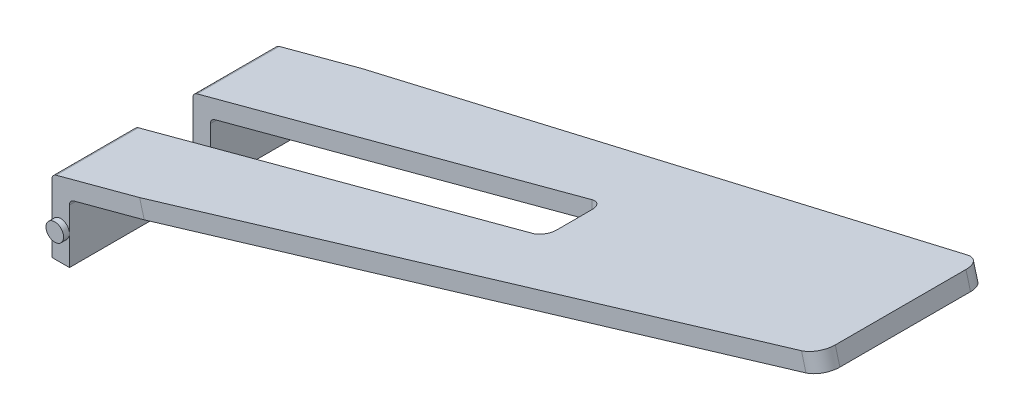
ISO-10303-21;
HEADER;
FILE_DESCRIPTION(('STEP AP214'),'2;1');
FILE_NAME('part.step','',(''),(''),'','','');
FILE_SCHEMA(('AUTOMOTIVE_DESIGN { 1 0 10303 214 1 1 1 1 }'));
ENDSEC;
DATA;
#1=APPLICATION_CONTEXT('core data for automotive mechanical design processes');
#2=APPLICATION_PROTOCOL_DEFINITION('international standard','automotive_design',2000,#1);
#3=PRODUCT_CONTEXT('',#1,'mechanical');
#4=PRODUCT('Part','Part','',(#3));
#5=PRODUCT_RELATED_PRODUCT_CATEGORY('part','',(#4));
#6=PRODUCT_DEFINITION_FORMATION('','',#4);
#7=PRODUCT_DEFINITION_CONTEXT('part definition',#1,'design');
#8=PRODUCT_DEFINITION('design','',#6,#7);
#9=PRODUCT_DEFINITION_SHAPE('','',#8);
#10=(LENGTH_UNIT() NAMED_UNIT(*) SI_UNIT(.MILLI.,.METRE.));
#11=(NAMED_UNIT(*) PLANE_ANGLE_UNIT() SI_UNIT($,.RADIAN.));
#12=(NAMED_UNIT(*) SI_UNIT($,.STERADIAN.) SOLID_ANGLE_UNIT());
#13=UNCERTAINTY_MEASURE_WITH_UNIT(LENGTH_MEASURE(1.E-05),#10,'distance_accuracy_value','');
#14=(GEOMETRIC_REPRESENTATION_CONTEXT(3) GLOBAL_UNCERTAINTY_ASSIGNED_CONTEXT((#13)) GLOBAL_UNIT_ASSIGNED_CONTEXT((#10,
#11,#12)) REPRESENTATION_CONTEXT('',''));
#15=CARTESIAN_POINT('',(0.,0.,0.));
#16=DIRECTION('',(0.,0.,1.));
#17=DIRECTION('',(1.,0.,0.));
#18=AXIS2_PLACEMENT_3D('',#15,#16,#17);
#19=CARTESIAN_POINT('',(0.3,0.,3.8));
#20=DIRECTION('',(0.,1.,0.));
#21=DIRECTION('',(0.,0.,1.));
#22=AXIS2_PLACEMENT_3D('',#19,#20,#21);
#23=PLANE('',#22);
#24=DIRECTION('',(0.,0.,-1.));
#25=VECTOR('',#24,1.);
#26=CARTESIAN_POINT('',(0.,0.,3.8));
#27=LINE('',#26,#25);
#28=CARTESIAN_POINT('',(0.,0.,3.8));
#29=VERTEX_POINT('',#28);
#30=CARTESIAN_POINT('',(0.,0.,2.40000000000001));
#31=VERTEX_POINT('',#30);
#32=EDGE_CURVE('E224',#29,#31,#27,.T.);
#33=ORIENTED_EDGE('',*,*,#32,.T.);
#34=DIRECTION('',(-1.,0.,0.));
#35=VECTOR('',#34,1.);
#36=CARTESIAN_POINT('',(0.,0.,2.40000000000001));
#37=LINE('',#36,#35);
#38=CARTESIAN_POINT('',(0.3,0.,2.40000000000001));
#39=VERTEX_POINT('',#38);
#40=EDGE_CURVE('E218',#39,#31,#37,.T.);
#41=ORIENTED_EDGE('',*,*,#40,.F.);
#42=DIRECTION('',(0.,0.,-1.));
#43=VECTOR('',#42,1.);
#44=CARTESIAN_POINT('',(0.3,0.,3.8));
#45=LINE('',#44,#43);
#46=CARTESIAN_POINT('',(0.3,0.,3.8));
#47=VERTEX_POINT('',#46);
#48=EDGE_CURVE('E240',#47,#39,#45,.T.);
#49=ORIENTED_EDGE('',*,*,#48,.F.);
#50=DIRECTION('',(1.,0.,0.));
#51=VECTOR('',#50,1.);
#52=CARTESIAN_POINT('',(0.3,0.,3.8));
#53=LINE('',#52,#51);
#54=EDGE_CURVE('E373',#29,#47,#53,.T.);
#55=ORIENTED_EDGE('',*,*,#54,.F.);
#56=EDGE_LOOP('',(#33,#41,#49,#55));
#57=FACE_BOUND('',#56,.T.);
#58=ADVANCED_FACE('F38',(#57),#23,.F.);
#59=CARTESIAN_POINT('',(0.3,1.,3.8));
#60=DIRECTION('',(-1.,0.,0.));
#61=DIRECTION('',(0.,-1.,0.));
#62=AXIS2_PLACEMENT_3D('',#59,#60,#61);
#63=PLANE('',#62);
#64=DIRECTION('',(0.,1.,0.));
#65=VECTOR('',#64,1.);
#66=CARTESIAN_POINT('',(0.3,1.,2.40000000000001));
#67=LINE('',#66,#65);
#68=CARTESIAN_POINT('',(0.3,0.923267301202103,2.40000000000001));
#69=VERTEX_POINT('',#68);
#70=EDGE_CURVE('E358',#39,#69,#67,.T.);
#71=ORIENTED_EDGE('',*,*,#70,.T.);
#72=DIRECTION('',(0.,0.,-1.));
#73=VECTOR('',#72,1.);
#74=CARTESIAN_POINT('',(0.3,0.923267301202103,3.8));
#75=LINE('',#74,#73);
#76=CARTESIAN_POINT('',(0.3,0.923267301202103,3.8));
#77=VERTEX_POINT('',#76);
#78=EDGE_CURVE('E291',#69,#77,#75,.F.);
#79=ORIENTED_EDGE('',*,*,#78,.T.);
#80=DIRECTION('',(0.,1.,0.));
#81=VECTOR('',#80,1.);
#82=CARTESIAN_POINT('',(0.3,1.,3.8));
#83=LINE('',#82,#81);
#84=CARTESIAN_POINT('',(0.3,0.5,3.8));
#85=VERTEX_POINT('',#84);
#86=EDGE_CURVE('E376',#85,#77,#83,.T.);
#87=ORIENTED_EDGE('',*,*,#86,.F.);
#88=EDGE_CURVE('E377',#47,#85,#83,.T.);
#89=ORIENTED_EDGE('',*,*,#88,.F.);
#90=ORIENTED_EDGE('',*,*,#48,.T.);
#91=EDGE_LOOP('',(#71,#79,#87,#89,#90));
#92=FACE_BOUND('',#91,.T.);
#93=ADVANCED_FACE('F427',(#92),#63,.F.);
#94=CARTESIAN_POINT('',(0.,0.,3.8));
#95=DIRECTION('',(1.,0.,0.));
#96=DIRECTION('',(0.,0.,-1.));
#97=AXIS2_PLACEMENT_3D('',#94,#95,#96);
#98=PLANE('',#97);
#99=DIRECTION('',(0.,-1.,0.));
#100=VECTOR('',#99,1.);
#101=CARTESIAN_POINT('',(0.,0.,3.8));
#102=LINE('',#101,#100);
#103=CARTESIAN_POINT('',(0.,1.15346539759579,3.8));
#104=VERTEX_POINT('',#103);
#105=CARTESIAN_POINT('',(0.,0.5,3.8));
#106=VERTEX_POINT('',#105);
#107=EDGE_CURVE('E225',#104,#106,#102,.T.);
#108=ORIENTED_EDGE('',*,*,#107,.F.);
#109=DIRECTION('',(0.,0.,-1.));
#110=VECTOR('',#109,1.);
#111=CARTESIAN_POINT('',(0.,1.15346539759579,3.8));
#112=LINE('',#111,#110);
#113=CARTESIAN_POINT('',(0.,1.15346539759579,2.40000000000001));
#114=VERTEX_POINT('',#113);
#115=EDGE_CURVE('E275',#104,#114,#112,.T.);
#116=ORIENTED_EDGE('',*,*,#115,.T.);
#117=DIRECTION('',(0.,-1.,0.));
#118=VECTOR('',#117,1.);
#119=CARTESIAN_POINT('',(0.,0.,2.40000000000001));
#120=LINE('',#119,#118);
#121=EDGE_CURVE('E209',#114,#31,#120,.T.);
#122=ORIENTED_EDGE('',*,*,#121,.T.);
#123=ORIENTED_EDGE('',*,*,#32,.F.);
#124=EDGE_CURVE('E229',#106,#29,#102,.T.);
#125=ORIENTED_EDGE('',*,*,#124,.F.);
#126=EDGE_LOOP('',(#108,#116,#122,#123,#125));
#127=FACE_BOUND('',#126,.T.);
#128=ADVANCED_FACE('F433',(#127),#98,.F.);
#129=CARTESIAN_POINT('',(0.,0.,3.8));
#130=DIRECTION('',(0.,0.,-1.));
#131=DIRECTION('',(-1.,0.,0.));
#132=AXIS2_PLACEMENT_3D('',#129,#130,#131);
#133=PLANE('',#132);
#134=DIRECTION('',(-0.965925826289069,-0.258819045102518,0.));
#135=VECTOR('',#134,1.);
#136=CARTESIAN_POINT('',(0.,1.23019809639369,3.8));
#137=LINE('',#136,#135);
#138=CARTESIAN_POINT('',(1.49536641050825,1.630880318478,3.8));
#139=VERTEX_POINT('',#138);
#140=CARTESIAN_POINT('',(0.0741180954897482,1.2500579802247,3.8));
#141=VERTEX_POINT('',#140);
#142=EDGE_CURVE('E383',#139,#141,#137,.T.);
#143=ORIENTED_EDGE('',*,*,#142,.T.);
#144=CARTESIAN_POINT('',(0.1,1.15346539759579,3.8));
#145=DIRECTION('',(0.,0.,-1.));
#146=DIRECTION('',(-1.,0.,0.));
#147=AXIS2_PLACEMENT_3D('',#144,#145,#146);
#148=CIRCLE('',#147,0.1);
#149=EDGE_CURVE('E281',#141,#104,#148,.F.);
#150=ORIENTED_EDGE('',*,*,#149,.T.);
#151=ORIENTED_EDGE('',*,*,#107,.T.);
#152=CARTESIAN_POINT('',(0.15,0.5,3.8));
#153=DIRECTION('',(0.,0.,-1.));
#154=DIRECTION('',(-1.,0.,0.));
#155=AXIS2_PLACEMENT_3D('',#152,#153,#154);
#156=CIRCLE('',#155,0.15);
#157=EDGE_CURVE('E372',#106,#85,#156,.T.);
#158=ORIENTED_EDGE('',*,*,#157,.T.);
#159=ORIENTED_EDGE('',*,*,#86,.T.);
#160=CARTESIAN_POINT('',(0.399999999999999,0.923267301202103,3.8));
#161=DIRECTION('',(0.,0.,-1.));
#162=DIRECTION('',(-1.,0.,0.));
#163=AXIS2_PLACEMENT_3D('',#160,#161,#162);
#164=CIRCLE('',#163,0.1);
#165=CARTESIAN_POINT('',(0.374118095489749,1.01985988383101,3.8));
#166=VERTEX_POINT('',#165);
#167=EDGE_CURVE('E300',#77,#166,#164,.T.);
#168=ORIENTED_EDGE('',*,*,#167,.T.);
#169=DIRECTION('',(0.965925826289069,0.258819045102518,0.));
#170=VECTOR('',#169,1.);
#171=CARTESIAN_POINT('',(12.6346814552887,4.3050679348397,3.8));
#172=LINE('',#171,#170);
#173=CARTESIAN_POINT('',(1.57301212403901,1.34110257059128,3.8));
#174=VERTEX_POINT('',#173);
#175=EDGE_CURVE('E380',#166,#174,#172,.T.);
#176=ORIENTED_EDGE('',*,*,#175,.T.);
#177=DIRECTION('',(-0.258819045102518,0.965925826289069,0.));
#178=VECTOR('',#177,1.);
#179=CARTESIAN_POINT('',(1.80291593460667,0.483089868699056,3.8));
#180=LINE('',#179,#178);
#181=EDGE_CURVE('E243',#174,#139,#180,.T.);
#182=ORIENTED_EDGE('',*,*,#181,.T.);
#183=EDGE_LOOP('',(#143,#150,#151,#158,#159,#168,#176,#182));
#184=FACE_BOUND('',#183,.T.);
#185=ADVANCED_FACE('F444',(#184),#133,.F.);
#186=CARTESIAN_POINT('',(0.,0.,0.));
#187=DIRECTION('',(0.,0.,-1.));
#188=DIRECTION('',(-1.,0.,0.));
#189=AXIS2_PLACEMENT_3D('',#186,#187,#188);
#190=PLANE('',#189);
#191=DIRECTION('',(0.,-1.,0.));
#192=VECTOR('',#191,1.);
#193=CARTESIAN_POINT('',(0.,0.,0.));
#194=LINE('',#193,#192);
#195=CARTESIAN_POINT('',(0.,1.15346539759579,0.));
#196=VERTEX_POINT('',#195);
#197=CARTESIAN_POINT('',(0.,0.5,0.));
#198=VERTEX_POINT('',#197);
#199=EDGE_CURVE('E233',#196,#198,#194,.T.);
#200=ORIENTED_EDGE('',*,*,#199,.F.);
#201=CARTESIAN_POINT('',(0.1,1.15346539759579,0.));
#202=DIRECTION('',(0.,0.,-1.));
#203=DIRECTION('',(-1.,0.,0.));
#204=AXIS2_PLACEMENT_3D('',#201,#202,#203);
#205=CIRCLE('',#204,0.1);
#206=CARTESIAN_POINT('',(0.0741180954897482,1.2500579802247,0.));
#207=VERTEX_POINT('',#206);
#208=EDGE_CURVE('E268',#196,#207,#205,.T.);
#209=ORIENTED_EDGE('',*,*,#208,.T.);
#210=DIRECTION('',(-0.965925826289069,-0.258819045102518,0.));
#211=VECTOR('',#210,1.);
#212=CARTESIAN_POINT('',(0.,1.23019809639369,0.));
#213=LINE('',#212,#211);
#214=CARTESIAN_POINT('',(1.49536641050825,1.630880318478,0.));
#215=VERTEX_POINT('',#214);
#216=EDGE_CURVE('E393',#215,#207,#213,.T.);
#217=ORIENTED_EDGE('',*,*,#216,.F.);
#218=DIRECTION('',(0.258819045102518,-0.965925826289069,0.));
#219=VECTOR('',#218,1.);
#220=CARTESIAN_POINT('',(1.57301212403901,1.34110257059127,0.));
#221=LINE('',#220,#219);
#222=CARTESIAN_POINT('',(1.57301212403901,1.34110257059128,0.));
#223=VERTEX_POINT('',#222);
#224=EDGE_CURVE('E256',#215,#223,#221,.T.);
#225=ORIENTED_EDGE('',*,*,#224,.T.);
#226=DIRECTION('',(0.965925826289069,0.258819045102518,0.));
#227=VECTOR('',#226,1.);
#228=CARTESIAN_POINT('',(12.6346814552887,4.3050679348397,0.));
#229=LINE('',#228,#227);
#230=CARTESIAN_POINT('',(0.374118095489749,1.01985988383101,0.));
#231=VERTEX_POINT('',#230);
#232=EDGE_CURVE('E392',#231,#223,#229,.T.);
#233=ORIENTED_EDGE('',*,*,#232,.F.);
#234=CARTESIAN_POINT('',(0.399999999999999,0.923267301202103,0.));
#235=DIRECTION('',(0.,0.,-1.));
#236=DIRECTION('',(-1.,0.,0.));
#237=AXIS2_PLACEMENT_3D('',#234,#235,#236);
#238=CIRCLE('',#237,0.1);
#239=CARTESIAN_POINT('',(0.3,0.923267301202103,0.));
#240=VERTEX_POINT('',#239);
#241=EDGE_CURVE('E293',#231,#240,#238,.F.);
#242=ORIENTED_EDGE('',*,*,#241,.T.);
#243=DIRECTION('',(0.,1.,0.));
#244=VECTOR('',#243,1.);
#245=CARTESIAN_POINT('',(0.3,1.,0.));
#246=LINE('',#245,#244);
#247=CARTESIAN_POINT('',(0.3,0.5,0.));
#248=VERTEX_POINT('',#247);
#249=EDGE_CURVE('E388',#248,#240,#246,.T.);
#250=ORIENTED_EDGE('',*,*,#249,.F.);
#251=CARTESIAN_POINT('',(0.15,0.5,0.));
#252=DIRECTION('',(0.,0.,-1.));
#253=DIRECTION('',(-1.,0.,0.));
#254=AXIS2_PLACEMENT_3D('',#251,#252,#253);
#255=CIRCLE('',#254,0.15);
#256=EDGE_CURVE('E210',#198,#248,#255,.T.);
#257=ORIENTED_EDGE('',*,*,#256,.F.);
#258=EDGE_LOOP('',(#200,#209,#217,#225,#233,#242,#250,#257));
#259=FACE_BOUND('',#258,.T.);
#260=ADVANCED_FACE('F405',(#259),#190,.T.);
#261=CARTESIAN_POINT('',(0.3,0.,1.4));
#262=VERTEX_POINT('',#261);
#263=CARTESIAN_POINT('',(0.3,0.,0.));
#264=VERTEX_POINT('',#263);
#265=EDGE_CURVE('E217',#262,#264,#45,.T.);
#266=ORIENTED_EDGE('',*,*,#265,.F.);
#267=DIRECTION('',(1.,0.,0.));
#268=VECTOR('',#267,1.);
#269=CARTESIAN_POINT('',(0.,0.,1.4));
#270=LINE('',#269,#268);
#271=CARTESIAN_POINT('',(0.,0.,1.4));
#272=VERTEX_POINT('',#271);
#273=EDGE_CURVE('E201',#272,#262,#270,.T.);
#274=ORIENTED_EDGE('',*,*,#273,.F.);
#275=CARTESIAN_POINT('',(0.,0.,0.));
#276=VERTEX_POINT('',#275);
#277=EDGE_CURVE('E215',#272,#276,#27,.T.);
#278=ORIENTED_EDGE('',*,*,#277,.T.);
#279=DIRECTION('',(1.,0.,0.));
#280=VECTOR('',#279,1.);
#281=CARTESIAN_POINT('',(0.3,0.,0.));
#282=LINE('',#281,#280);
#283=EDGE_CURVE('E386',#276,#264,#282,.T.);
#284=ORIENTED_EDGE('',*,*,#283,.T.);
#285=EDGE_LOOP('',(#266,#274,#278,#284));
#286=FACE_BOUND('',#285,.T.);
#287=ADVANCED_FACE('F213',(#286),#23,.F.);
#288=ORIENTED_EDGE('',*,*,#249,.T.);
#289=DIRECTION('',(0.,0.,-1.));
#290=VECTOR('',#289,1.);
#291=CARTESIAN_POINT('',(0.3,0.923267301202103,1.4));
#292=LINE('',#291,#290);
#293=CARTESIAN_POINT('',(0.3,0.923267301202103,1.4));
#294=VERTEX_POINT('',#293);
#295=EDGE_CURVE('E289',#240,#294,#292,.F.);
#296=ORIENTED_EDGE('',*,*,#295,.T.);
#297=DIRECTION('',(0.,-1.,0.));
#298=VECTOR('',#297,1.);
#299=CARTESIAN_POINT('',(0.3,1.,1.4));
#300=LINE('',#299,#298);
#301=EDGE_CURVE('E348',#294,#262,#300,.T.);
#302=ORIENTED_EDGE('',*,*,#301,.T.);
#303=ORIENTED_EDGE('',*,*,#265,.T.);
#304=EDGE_CURVE('E389',#264,#248,#246,.T.);
#305=ORIENTED_EDGE('',*,*,#304,.T.);
#306=EDGE_LOOP('',(#288,#296,#302,#303,#305));
#307=FACE_BOUND('',#306,.T.);
#308=ADVANCED_FACE('F436',(#307),#63,.F.);
#309=CARTESIAN_POINT('',(12.6346814552887,4.3050679348397,3.8));
#310=DIRECTION('',(-0.258819045102518,0.965925826289069,0.));
#311=DIRECTION('',(-0.965925826289069,-0.258819045102518,0.));
#312=AXIS2_PLACEMENT_3D('',#309,#310,#311);
#313=PLANE('',#312);
#314=DIRECTION('',(0.965006478934081,0.258572706721185,0.0436193873653364));
#315=VECTOR('',#314,1.);
#316=CARTESIAN_POINT('',(12.6346814552887,4.3050679348397,0.5));
#317=LINE('',#316,#315);
#318=CARTESIAN_POINT('',(12.3575436352369,4.2308090797647,0.487473056201885));
#319=VERTEX_POINT('',#318);
#320=EDGE_CURVE('E251',#223,#319,#317,.T.);
#321=ORIENTED_EDGE('',*,*,#320,.T.);
#322=CARTESIAN_POINT('',(12.3449037074019,4.22742222130895,0.787187522676442));
#323=DIRECTION('',(-0.258819045102518,0.965925826289069,0.));
#324=DIRECTION('',(-0.965925826289069,-0.258819045102518,0.));
#325=AXIS2_PLACEMENT_3D('',#322,#323,#324);
#326=CIRCLE('',#325,0.3);
#327=CARTESIAN_POINT('',(12.6346814552887,4.3050679348397,0.787187522676443));
#328=VERTEX_POINT('',#327);
#329=EDGE_CURVE('E316',#319,#328,#326,.F.);
#330=ORIENTED_EDGE('',*,*,#329,.T.);
#331=DIRECTION('',(0.,0.,-1.));
#332=VECTOR('',#331,1.);
#333=CARTESIAN_POINT('',(12.6346814552887,4.3050679348397,3.8));
#334=LINE('',#333,#332);
#335=CARTESIAN_POINT('',(12.6346814552887,4.3050679348397,3.01281247732356));
#336=VERTEX_POINT('',#335);
#337=EDGE_CURVE('E237',#336,#328,#334,.T.);
#338=ORIENTED_EDGE('',*,*,#337,.F.);
#339=CARTESIAN_POINT('',(12.3449037074019,4.22742222130895,3.01281247732356));
#340=DIRECTION('',(-0.258819045102518,0.965925826289069,0.));
#341=DIRECTION('',(-0.965925826289069,-0.258819045102518,0.));
#342=AXIS2_PLACEMENT_3D('',#339,#340,#341);
#343=CIRCLE('',#342,0.3);
#344=CARTESIAN_POINT('',(12.3575436352369,4.2308090797647,3.31252694379812));
#345=VERTEX_POINT('',#344);
#346=EDGE_CURVE('E314',#336,#345,#343,.F.);
#347=ORIENTED_EDGE('',*,*,#346,.T.);
#348=DIRECTION('',(0.965006478934081,0.258572706721185,-0.0436193873653364));
#349=VECTOR('',#348,1.);
#350=CARTESIAN_POINT('',(1.57301212403901,1.34110257059128,3.8));
#351=LINE('',#350,#349);
#352=EDGE_CURVE('E254',#345,#174,#351,.F.);
#353=ORIENTED_EDGE('',*,*,#352,.T.);
#354=ORIENTED_EDGE('',*,*,#175,.F.);
#355=DIRECTION('',(0.,0.,-1.));
#356=VECTOR('',#355,1.);
#357=CARTESIAN_POINT('',(0.374118095489747,1.01985988383101,2.40000000000001));
#358=LINE('',#357,#356);
#359=CARTESIAN_POINT('',(0.374118095489746,1.01985988383101,2.40000000000001));
#360=VERTEX_POINT('',#359);
#361=EDGE_CURVE('E283',#166,#360,#358,.T.);
#362=ORIENTED_EDGE('',*,*,#361,.T.);
#363=DIRECTION('',(0.965925826289069,0.258819045102518,0.));
#364=VECTOR('',#363,1.);
#365=CARTESIAN_POINT('',(12.6346814552887,4.3050679348397,2.40000000000001));
#366=LINE('',#365,#364);
#367=CARTESIAN_POINT('',(6.8,2.74166975080228,2.40000000000001));
#368=VERTEX_POINT('',#367);
#369=EDGE_CURVE('E347',#360,#368,#366,.T.);
#370=ORIENTED_EDGE('',*,*,#369,.T.);
#371=CARTESIAN_POINT('',(6.8,2.74166975080228,2.20000000000001));
#372=DIRECTION('',(-0.258819045102518,0.965925826289069,0.));
#373=DIRECTION('',(0.965925826289069,0.258819045102518,0.));
#374=AXIS2_PLACEMENT_3D('',#371,#372,#373);
#375=ELLIPSE('',#374,0.207055236082016,0.2);
#376=CARTESIAN_POINT('',(7.,2.7952595892885,2.20000000000001));
#377=VERTEX_POINT('',#376);
#378=EDGE_CURVE('E329',#368,#377,#375,.T.);
#379=ORIENTED_EDGE('',*,*,#378,.T.);
#380=DIRECTION('',(0.,0.,-1.));
#381=VECTOR('',#380,1.);
#382=CARTESIAN_POINT('',(7.,2.7952595892885,3.79999999999999));
#383=LINE('',#382,#381);
#384=CARTESIAN_POINT('',(7.,2.7952595892885,1.60000000000001));
#385=VERTEX_POINT('',#384);
#386=EDGE_CURVE('E353',#377,#385,#383,.T.);
#387=ORIENTED_EDGE('',*,*,#386,.T.);
#388=CARTESIAN_POINT('',(6.8,2.74166975080228,1.60000000000001));
#389=DIRECTION('',(-0.258819045102518,0.965925826289069,0.));
#390=DIRECTION('',(0.965925826289069,0.258819045102518,0.));
#391=AXIS2_PLACEMENT_3D('',#388,#389,#390);
#392=ELLIPSE('',#391,0.207055236082016,0.2);
#393=CARTESIAN_POINT('',(6.8,2.74166975080228,1.40000000000001));
#394=VERTEX_POINT('',#393);
#395=EDGE_CURVE('E46',#385,#394,#392,.T.);
#396=ORIENTED_EDGE('',*,*,#395,.T.);
#397=DIRECTION('',(-0.965925826289069,-0.258819045102518,0.));
#398=VECTOR('',#397,1.);
#399=CARTESIAN_POINT('',(12.6346814552887,4.3050679348397,1.40000000000002));
#400=LINE('',#399,#398);
#401=CARTESIAN_POINT('',(0.374118095489746,1.01985988383101,1.4));
#402=VERTEX_POINT('',#401);
#403=EDGE_CURVE('E478',#394,#402,#400,.T.);
#404=ORIENTED_EDGE('',*,*,#403,.T.);
#405=DIRECTION('',(0.,0.,-1.));
#406=VECTOR('',#405,1.);
#407=CARTESIAN_POINT('',(0.374118095489747,1.01985988383101,0.));
#408=LINE('',#407,#406);
#409=EDGE_CURVE('E286',#402,#231,#408,.T.);
#410=ORIENTED_EDGE('',*,*,#409,.T.);
#411=ORIENTED_EDGE('',*,*,#232,.T.);
#412=EDGE_LOOP('',(#321,#330,#338,#347,#353,#354,#362,#370,#379,#387,#396,#404,#410,#411));
#413=FACE_BOUND('',#412,.T.);
#414=ADVANCED_FACE('F352',(#413),#313,.F.);
#415=CARTESIAN_POINT('',(12.5570357417579,4.59484568272643,3.8));
#416=DIRECTION('',(-0.965925826289069,-0.258819045102518,0.));
#417=DIRECTION('',(0.258819045102518,-0.965925826289069,0.));
#418=AXIS2_PLACEMENT_3D('',#415,#416,#417);
#419=PLANE('',#418);
#420=ORIENTED_EDGE('',*,*,#337,.T.);
#421=DIRECTION('',(-0.258819045102518,0.965925826289069,0.));
#422=VECTOR('',#421,1.);
#423=CARTESIAN_POINT('',(12.5570357417579,4.59484568272643,0.787187522676442));
#424=LINE('',#423,#422);
#425=CARTESIAN_POINT('',(12.5570357417579,4.59484568272643,0.787187522676443));
#426=VERTEX_POINT('',#425);
#427=EDGE_CURVE('E305',#328,#426,#424,.T.);
#428=ORIENTED_EDGE('',*,*,#427,.T.);
#429=DIRECTION('',(0.,0.,-1.));
#430=VECTOR('',#429,1.);
#431=CARTESIAN_POINT('',(12.5570357417579,4.59484568272643,3.8));
#432=LINE('',#431,#430);
#433=CARTESIAN_POINT('',(12.5570357417579,4.59484568272643,3.01281247732356));
#434=VERTEX_POINT('',#433);
#435=EDGE_CURVE('E228',#434,#426,#432,.T.);
#436=ORIENTED_EDGE('',*,*,#435,.F.);
#437=DIRECTION('',(-0.258819045102518,0.965925826289069,0.));
#438=VECTOR('',#437,1.);
#439=CARTESIAN_POINT('',(12.6346814552887,4.3050679348397,3.01281247732356));
#440=LINE('',#439,#438);
#441=EDGE_CURVE('E302',#434,#336,#440,.F.);
#442=ORIENTED_EDGE('',*,*,#441,.T.);
#443=EDGE_LOOP('',(#420,#428,#436,#442));
#444=FACE_BOUND('',#443,.T.);
#445=ADVANCED_FACE('F502',(#444),#419,.F.);
#446=CARTESIAN_POINT('',(0.,1.23019809639369,3.8));
#447=DIRECTION('',(0.258819045102518,-0.965925826289069,0.));
#448=DIRECTION('',(0.965925826289069,0.258819045102518,0.));
#449=AXIS2_PLACEMENT_3D('',#446,#447,#448);
#450=PLANE('',#449);
#451=ORIENTED_EDGE('',*,*,#435,.T.);
#452=CARTESIAN_POINT('',(12.2672579938712,4.51719996919567,0.787187522676442));
#453=DIRECTION('',(0.258819045102518,-0.965925826289069,0.));
#454=DIRECTION('',(0.965925826289069,0.258819045102518,0.));
#455=AXIS2_PLACEMENT_3D('',#452,#453,#454);
#456=CIRCLE('',#455,0.3);
#457=CARTESIAN_POINT('',(12.2798979217061,4.52058682765143,0.487473056201885));
#458=VERTEX_POINT('',#457);
#459=EDGE_CURVE('E310',#426,#458,#456,.F.);
#460=ORIENTED_EDGE('',*,*,#459,.T.);
#461=DIRECTION('',(-0.965006478934081,-0.258572706721186,-0.0436193873653365));
#462=VECTOR('',#461,1.);
#463=CARTESIAN_POINT('',(12.5570357417579,4.59484568272643,0.5));
#464=LINE('',#463,#462);
#465=EDGE_CURVE('E246',#458,#215,#464,.T.);
#466=ORIENTED_EDGE('',*,*,#465,.T.);
#467=ORIENTED_EDGE('',*,*,#216,.T.);
#468=DIRECTION('',(0.,0.,-1.));
#469=VECTOR('',#468,1.);
#470=CARTESIAN_POINT('',(0.0741180954897482,1.2500579802247,3.8));
#471=LINE('',#470,#469);
#472=CARTESIAN_POINT('',(0.0741180954897481,1.2500579802247,1.4));
#473=VERTEX_POINT('',#472);
#474=EDGE_CURVE('E272',#207,#473,#471,.F.);
#475=ORIENTED_EDGE('',*,*,#474,.T.);
#476=DIRECTION('',(0.965925826289069,0.258819045102518,0.));
#477=VECTOR('',#476,1.);
#478=CARTESIAN_POINT('',(0.,1.23019809639369,1.4));
#479=LINE('',#478,#477);
#480=CARTESIAN_POINT('',(6.8,3.05225260492531,1.40000000000001));
#481=VERTEX_POINT('',#480);
#482=EDGE_CURVE('E480',#473,#481,#479,.T.);
#483=ORIENTED_EDGE('',*,*,#482,.T.);
#484=CARTESIAN_POINT('',(6.8,3.0522526049253,1.60000000000001));
#485=DIRECTION('',(0.258819045102518,-0.965925826289069,0.));
#486=DIRECTION('',(0.965925826289069,0.258819045102518,0.));
#487=AXIS2_PLACEMENT_3D('',#484,#485,#486);
#488=ELLIPSE('',#487,0.207055236082016,0.2);
#489=CARTESIAN_POINT('',(7.,3.10584244341153,1.60000000000001));
#490=VERTEX_POINT('',#489);
#491=EDGE_CURVE('E11',#481,#490,#488,.T.);
#492=ORIENTED_EDGE('',*,*,#491,.T.);
#493=DIRECTION('',(0.,0.,1.));
#494=VECTOR('',#493,1.);
#495=CARTESIAN_POINT('',(7.,3.10584244341153,3.80000000000001));
#496=LINE('',#495,#494);
#497=CARTESIAN_POINT('',(7.,3.10584244341153,2.20000000000001));
#498=VERTEX_POINT('',#497);
#499=EDGE_CURVE('E263',#490,#498,#496,.T.);
#500=ORIENTED_EDGE('',*,*,#499,.T.);
#501=CARTESIAN_POINT('',(6.8,3.0522526049253,2.20000000000001));
#502=DIRECTION('',(0.258819045102518,-0.965925826289069,0.));
#503=DIRECTION('',(0.965925826289069,0.258819045102518,0.));
#504=AXIS2_PLACEMENT_3D('',#501,#502,#503);
#505=ELLIPSE('',#504,0.207055236082016,0.2);
#506=CARTESIAN_POINT('',(6.8,3.05225260492531,2.40000000000001));
#507=VERTEX_POINT('',#506);
#508=EDGE_CURVE('E331',#498,#507,#505,.T.);
#509=ORIENTED_EDGE('',*,*,#508,.T.);
#510=DIRECTION('',(-0.965925826289069,-0.258819045102518,0.));
#511=VECTOR('',#510,1.);
#512=CARTESIAN_POINT('',(0.,1.23019809639369,2.40000000000001));
#513=LINE('',#512,#511);
#514=CARTESIAN_POINT('',(0.0741180954897482,1.2500579802247,2.40000000000001));
#515=VERTEX_POINT('',#514);
#516=EDGE_CURVE('E336',#507,#515,#513,.T.);
#517=ORIENTED_EDGE('',*,*,#516,.T.);
#518=DIRECTION('',(0.,0.,-1.));
#519=VECTOR('',#518,1.);
#520=CARTESIAN_POINT('',(0.0741180954897482,1.2500579802247,3.8));
#521=LINE('',#520,#519);
#522=EDGE_CURVE('E270',#515,#141,#521,.F.);
#523=ORIENTED_EDGE('',*,*,#522,.T.);
#524=ORIENTED_EDGE('',*,*,#142,.F.);
#525=DIRECTION('',(-0.965006478934081,-0.258572706721186,0.0436193873653365));
#526=VECTOR('',#525,1.);
#527=CARTESIAN_POINT('',(1.49536641050825,1.630880318478,3.8));
#528=LINE('',#527,#526);
#529=CARTESIAN_POINT('',(12.2798979217061,4.52058682765143,3.31252694379812));
#530=VERTEX_POINT('',#529);
#531=EDGE_CURVE('E248',#139,#530,#528,.F.);
#532=ORIENTED_EDGE('',*,*,#531,.T.);
#533=CARTESIAN_POINT('',(12.2672579938712,4.51719996919567,3.01281247732356));
#534=DIRECTION('',(0.258819045102518,-0.965925826289069,0.));
#535=DIRECTION('',(0.965925826289069,0.258819045102518,0.));
#536=AXIS2_PLACEMENT_3D('',#533,#534,#535);
#537=CIRCLE('',#536,0.3);
#538=EDGE_CURVE('E308',#530,#434,#537,.F.);
#539=ORIENTED_EDGE('',*,*,#538,.T.);
#540=EDGE_LOOP('',(#451,#460,#466,#467,#475,#483,#492,#500,#509,#517,#523,#524,#532,#539));
#541=FACE_BOUND('',#540,.T.);
#542=ADVANCED_FACE('F335',(#541),#450,.F.);
#543=DIRECTION('',(0.,1.,0.));
#544=VECTOR('',#543,1.);
#545=CARTESIAN_POINT('',(0.,0.,1.4));
#546=LINE('',#545,#544);
#547=CARTESIAN_POINT('',(0.,1.15346539759579,1.4));
#548=VERTEX_POINT('',#547);
#549=EDGE_CURVE('E197',#272,#548,#546,.T.);
#550=ORIENTED_EDGE('',*,*,#549,.T.);
#551=DIRECTION('',(0.,0.,-1.));
#552=VECTOR('',#551,1.);
#553=CARTESIAN_POINT('',(0.,1.15346539759579,3.8));
#554=LINE('',#553,#552);
#555=EDGE_CURVE('E266',#548,#196,#554,.T.);
#556=ORIENTED_EDGE('',*,*,#555,.T.);
#557=ORIENTED_EDGE('',*,*,#199,.T.);
#558=EDGE_CURVE('E222',#198,#276,#194,.T.);
#559=ORIENTED_EDGE('',*,*,#558,.T.);
#560=ORIENTED_EDGE('',*,*,#277,.F.);
#561=EDGE_LOOP('',(#550,#556,#557,#559,#560));
#562=FACE_BOUND('',#561,.T.);
#563=ADVANCED_FACE('F220',(#562),#98,.F.);
#564=ORIENTED_EDGE('',*,*,#88,.T.);
#565=EDGE_CURVE('E369',#85,#106,#156,.T.);
#566=ORIENTED_EDGE('',*,*,#565,.T.);
#567=ORIENTED_EDGE('',*,*,#124,.T.);
#568=ORIENTED_EDGE('',*,*,#54,.T.);
#569=EDGE_LOOP('',(#564,#566,#567,#568));
#570=FACE_BOUND('',#569,.T.);
#571=ADVANCED_FACE('F451',(#570),#133,.F.);
#572=EDGE_CURVE('E259',#248,#198,#255,.T.);
#573=ORIENTED_EDGE('',*,*,#572,.F.);
#574=ORIENTED_EDGE('',*,*,#304,.F.);
#575=ORIENTED_EDGE('',*,*,#283,.F.);
#576=ORIENTED_EDGE('',*,*,#558,.F.);
#577=EDGE_LOOP('',(#573,#574,#575,#576));
#578=FACE_BOUND('',#577,.T.);
#579=ADVANCED_FACE('F401',(#578),#190,.T.);
#580=CARTESIAN_POINT('',(1.80291593460667,0.483089868699056,3.8));
#581=DIRECTION('',(-0.0421330927830856,-0.0112895281858532,-0.999048221581858));
#582=DIRECTION('',(-0.258819045102518,0.965925826289069,0.));
#583=AXIS2_PLACEMENT_3D('',#580,#581,#582);
#584=PLANE('',#583);
#585=ORIENTED_EDGE('',*,*,#352,.F.);
#586=DIRECTION('',(0.258819045102518,-0.965925826289069,0.));
#587=VECTOR('',#586,1.);
#588=CARTESIAN_POINT('',(12.2798979217061,4.52058682765143,3.31252694379811));
#589=LINE('',#588,#587);
#590=EDGE_CURVE('E318',#345,#530,#589,.F.);
#591=ORIENTED_EDGE('',*,*,#590,.T.);
#592=ORIENTED_EDGE('',*,*,#531,.F.);
#593=ORIENTED_EDGE('',*,*,#181,.F.);
#594=EDGE_LOOP('',(#585,#591,#592,#593));
#595=FACE_BOUND('',#594,.T.);
#596=ADVANCED_FACE('F422',(#595),#584,.F.);
#597=CARTESIAN_POINT('',(12.5570357417579,4.59484568272643,0.5));
#598=DIRECTION('',(0.0421330927830856,0.0112895281858532,-0.999048221581858));
#599=DIRECTION('',(0.258819045102518,-0.965925826289069,0.));
#600=AXIS2_PLACEMENT_3D('',#597,#598,#599);
#601=PLANE('',#600);
#602=ORIENTED_EDGE('',*,*,#465,.F.);
#603=DIRECTION('',(-0.258819045102518,0.965925826289069,0.));
#604=VECTOR('',#603,1.);
#605=CARTESIAN_POINT('',(12.3575436352369,4.2308090797647,0.487473056201885));
#606=LINE('',#605,#604);
#607=EDGE_CURVE('E312',#458,#319,#606,.F.);
#608=ORIENTED_EDGE('',*,*,#607,.T.);
#609=ORIENTED_EDGE('',*,*,#320,.F.);
#610=ORIENTED_EDGE('',*,*,#224,.F.);
#611=EDGE_LOOP('',(#602,#608,#609,#610));
#612=FACE_BOUND('',#611,.T.);
#613=ADVANCED_FACE('F417',(#612),#601,.T.);
#614=CARTESIAN_POINT('',(0.15,0.5,-0.0999999999999998));
#615=DIRECTION('',(0.,0.,1.));
#616=DIRECTION('',(1.,0.,0.));
#617=AXIS2_PLACEMENT_3D('',#614,#615,#616);
#618=PLANE('',#617);
#619=CARTESIAN_POINT('',(0.15,0.5,-0.0999999999999998));
#620=DIRECTION('',(0.,0.,1.));
#621=DIRECTION('',(1.,0.,0.));
#622=AXIS2_PLACEMENT_3D('',#619,#620,#621);
#623=CIRCLE('',#622,0.15);
#624=CARTESIAN_POINT('',(0.3,0.5,-0.0999999999999998));
#625=VERTEX_POINT('',#624);
#626=EDGE_CURVE('E361',#625,#625,#623,.T.);
#627=ORIENTED_EDGE('',*,*,#626,.F.);
#628=EDGE_LOOP('',(#627));
#629=FACE_BOUND('',#628,.T.);
#630=ADVANCED_FACE('F412',(#629),#618,.F.);
#631=CARTESIAN_POINT('',(0.15,0.5,-0.0999999999999998));
#632=DIRECTION('',(0.,0.,1.));
#633=DIRECTION('',(1.,0.,0.));
#634=AXIS2_PLACEMENT_3D('',#631,#632,#633);
#635=CYLINDRICAL_SURFACE('',#634,0.15);
#636=ORIENTED_EDGE('',*,*,#572,.T.);
#637=ORIENTED_EDGE('',*,*,#256,.T.);
#638=EDGE_LOOP('',(#636,#637));
#639=FACE_BOUND('',#638,.T.);
#640=ORIENTED_EDGE('',*,*,#626,.T.);
#641=EDGE_LOOP('',(#640));
#642=FACE_BOUND('',#641,.T.);
#643=ADVANCED_FACE('F408',(#639,#642),#635,.T.);
#644=CARTESIAN_POINT('',(0.15,0.5,3.9));
#645=DIRECTION('',(0.,0.,1.));
#646=DIRECTION('',(1.,0.,0.));
#647=AXIS2_PLACEMENT_3D('',#644,#645,#646);
#648=CIRCLE('',#647,0.15);
#649=CARTESIAN_POINT('',(0.3,0.5,3.9));
#650=VERTEX_POINT('',#649);
#651=EDGE_CURVE('E357',#650,#650,#648,.T.);
#652=ORIENTED_EDGE('',*,*,#651,.F.);
#653=EDGE_LOOP('',(#652));
#654=FACE_BOUND('',#653,.T.);
#655=ORIENTED_EDGE('',*,*,#157,.F.);
#656=ORIENTED_EDGE('',*,*,#565,.F.);
#657=EDGE_LOOP('',(#655,#656));
#658=FACE_BOUND('',#657,.T.);
#659=ADVANCED_FACE('F411',(#654,#658),#635,.T.);
#660=CARTESIAN_POINT('',(0.15,0.5,3.9));
#661=DIRECTION('',(0.,0.,1.));
#662=DIRECTION('',(1.,0.,0.));
#663=AXIS2_PLACEMENT_3D('',#660,#661,#662);
#664=PLANE('',#663);
#665=ORIENTED_EDGE('',*,*,#651,.T.);
#666=EDGE_LOOP('',(#665));
#667=FACE_BOUND('',#666,.T.);
#668=ADVANCED_FACE('F545',(#667),#664,.T.);
#669=CARTESIAN_POINT('',(7.,10.,2.40000000000001));
#670=DIRECTION('',(1.,0.,0.));
#671=DIRECTION('',(0.,0.,-1.));
#672=AXIS2_PLACEMENT_3D('',#669,#670,#671);
#673=PLANE('',#672);
#674=ORIENTED_EDGE('',*,*,#386,.F.);
#675=DIRECTION('',(0.,-1.,0.));
#676=VECTOR('',#675,1.);
#677=CARTESIAN_POINT('',(7.,3.10584244341153,2.20000000000001));
#678=LINE('',#677,#676);
#679=EDGE_CURVE('E326',#377,#498,#678,.F.);
#680=ORIENTED_EDGE('',*,*,#679,.T.);
#681=ORIENTED_EDGE('',*,*,#499,.F.);
#682=DIRECTION('',(0.,-1.,0.));
#683=VECTOR('',#682,1.);
#684=CARTESIAN_POINT('',(7.,2.7952595892885,1.60000000000001));
#685=LINE('',#684,#683);
#686=EDGE_CURVE('E323',#490,#385,#685,.T.);
#687=ORIENTED_EDGE('',*,*,#686,.T.);
#688=EDGE_LOOP('',(#674,#680,#681,#687));
#689=FACE_BOUND('',#688,.T.);
#690=ADVANCED_FACE('F355',(#689),#673,.F.);
#691=CARTESIAN_POINT('',(0.,10.,2.40000000000001));
#692=DIRECTION('',(0.,0.,1.));
#693=DIRECTION('',(1.,0.,0.));
#694=AXIS2_PLACEMENT_3D('',#691,#692,#693);
#695=PLANE('',#694);
#696=ORIENTED_EDGE('',*,*,#516,.F.);
#697=DIRECTION('',(0.,-1.,0.));
#698=VECTOR('',#697,1.);
#699=CARTESIAN_POINT('',(6.8,2.7952595892885,2.40000000000001));
#700=LINE('',#699,#698);
#701=EDGE_CURVE('E320',#507,#368,#700,.T.);
#702=ORIENTED_EDGE('',*,*,#701,.T.);
#703=ORIENTED_EDGE('',*,*,#369,.F.);
#704=CARTESIAN_POINT('',(0.399999999999999,0.923267301202103,2.40000000000001));
#705=DIRECTION('',(0.,0.,1.));
#706=DIRECTION('',(1.,0.,0.));
#707=AXIS2_PLACEMENT_3D('',#704,#705,#706);
#708=CIRCLE('',#707,0.1);
#709=EDGE_CURVE('E298',#360,#69,#708,.T.);
#710=ORIENTED_EDGE('',*,*,#709,.T.);
#711=ORIENTED_EDGE('',*,*,#70,.F.);
#712=ORIENTED_EDGE('',*,*,#40,.T.);
#713=ORIENTED_EDGE('',*,*,#121,.F.);
#714=CARTESIAN_POINT('',(0.1,1.15346539759579,2.40000000000001));
#715=DIRECTION('',(0.,0.,1.));
#716=DIRECTION('',(1.,0.,0.));
#717=AXIS2_PLACEMENT_3D('',#714,#715,#716);
#718=CIRCLE('',#717,0.1);
#719=EDGE_CURVE('E278',#114,#515,#718,.F.);
#720=ORIENTED_EDGE('',*,*,#719,.T.);
#721=EDGE_LOOP('',(#696,#702,#703,#710,#711,#712,#713,#720));
#722=FACE_BOUND('',#721,.T.);
#723=ADVANCED_FACE('F342',(#722),#695,.F.);
#724=CARTESIAN_POINT('',(0.,10.,1.4));
#725=DIRECTION('',(0.,0.,-1.));
#726=DIRECTION('',(-1.,0.,0.));
#727=AXIS2_PLACEMENT_3D('',#724,#725,#726);
#728=PLANE('',#727);
#729=ORIENTED_EDGE('',*,*,#403,.F.);
#730=DIRECTION('',(0.,-1.,0.));
#731=VECTOR('',#730,1.);
#732=CARTESIAN_POINT('',(6.8,3.10584244341153,1.40000000000001));
#733=LINE('',#732,#731);
#734=EDGE_CURVE('E59',#394,#481,#733,.F.);
#735=ORIENTED_EDGE('',*,*,#734,.T.);
#736=ORIENTED_EDGE('',*,*,#482,.F.);
#737=CARTESIAN_POINT('',(0.1,1.15346539759579,1.4));
#738=DIRECTION('',(0.,0.,-1.));
#739=DIRECTION('',(-1.,0.,0.));
#740=AXIS2_PLACEMENT_3D('',#737,#738,#739);
#741=CIRCLE('',#740,0.1);
#742=EDGE_CURVE('E204',#473,#548,#741,.F.);
#743=ORIENTED_EDGE('',*,*,#742,.T.);
#744=ORIENTED_EDGE('',*,*,#549,.F.);
#745=ORIENTED_EDGE('',*,*,#273,.T.);
#746=ORIENTED_EDGE('',*,*,#301,.F.);
#747=CARTESIAN_POINT('',(0.399999999999999,0.923267301202103,1.4));
#748=DIRECTION('',(0.,0.,-1.));
#749=DIRECTION('',(-1.,0.,0.));
#750=AXIS2_PLACEMENT_3D('',#747,#748,#749);
#751=CIRCLE('',#750,0.1);
#752=EDGE_CURVE('E295',#294,#402,#751,.T.);
#753=ORIENTED_EDGE('',*,*,#752,.T.);
#754=EDGE_LOOP('',(#729,#735,#736,#743,#744,#745,#746,#753));
#755=FACE_BOUND('',#754,.T.);
#756=ADVANCED_FACE('F199',(#755),#728,.F.);
#757=CARTESIAN_POINT('',(0.1,1.15346539759579,3.8));
#758=DIRECTION('',(0.,0.,-1.));
#759=DIRECTION('',(-1.,0.,0.));
#760=AXIS2_PLACEMENT_3D('',#757,#758,#759);
#761=CYLINDRICAL_SURFACE('',#760,0.1);
#762=ORIENTED_EDGE('',*,*,#742,.F.);
#763=ORIENTED_EDGE('',*,*,#474,.F.);
#764=ORIENTED_EDGE('',*,*,#208,.F.);
#765=ORIENTED_EDGE('',*,*,#555,.F.);
#766=EDGE_LOOP('',(#762,#763,#764,#765));
#767=FACE_BOUND('',#766,.T.);
#768=ADVANCED_FACE('F513',(#767),#761,.T.);
#769=CARTESIAN_POINT('',(0.1,1.15346539759579,3.8));
#770=DIRECTION('',(0.,0.,-1.));
#771=DIRECTION('',(-1.,0.,0.));
#772=AXIS2_PLACEMENT_3D('',#769,#770,#771);
#773=CYLINDRICAL_SURFACE('',#772,0.1);
#774=ORIENTED_EDGE('',*,*,#149,.F.);
#775=ORIENTED_EDGE('',*,*,#522,.F.);
#776=ORIENTED_EDGE('',*,*,#719,.F.);
#777=ORIENTED_EDGE('',*,*,#115,.F.);
#778=EDGE_LOOP('',(#774,#775,#776,#777));
#779=FACE_BOUND('',#778,.T.);
#780=ADVANCED_FACE('F490',(#779),#773,.T.);
#781=CARTESIAN_POINT('',(0.399999999999999,0.923267301202103,3.8));
#782=DIRECTION('',(0.,0.,1.));
#783=DIRECTION('',(1.,0.,0.));
#784=AXIS2_PLACEMENT_3D('',#781,#782,#783);
#785=CYLINDRICAL_SURFACE('',#784,0.1);
#786=ORIENTED_EDGE('',*,*,#752,.F.);
#787=ORIENTED_EDGE('',*,*,#295,.F.);
#788=ORIENTED_EDGE('',*,*,#241,.F.);
#789=ORIENTED_EDGE('',*,*,#409,.F.);
#790=EDGE_LOOP('',(#786,#787,#788,#789));
#791=FACE_BOUND('',#790,.T.);
#792=ADVANCED_FACE('F529',(#791),#785,.F.);
#793=CARTESIAN_POINT('',(0.399999999999999,0.923267301202103,3.8));
#794=DIRECTION('',(0.,0.,1.));
#795=DIRECTION('',(1.,0.,0.));
#796=AXIS2_PLACEMENT_3D('',#793,#794,#795);
#797=CYLINDRICAL_SURFACE('',#796,0.1);
#798=ORIENTED_EDGE('',*,*,#167,.F.);
#799=ORIENTED_EDGE('',*,*,#78,.F.);
#800=ORIENTED_EDGE('',*,*,#709,.F.);
#801=ORIENTED_EDGE('',*,*,#361,.F.);
#802=EDGE_LOOP('',(#798,#799,#800,#801));
#803=FACE_BOUND('',#802,.T.);
#804=ADVANCED_FACE('F475',(#803),#797,.F.);
#805=CARTESIAN_POINT('',(12.2672579938712,4.51719996919567,0.787187522676442));
#806=DIRECTION('',(0.258819045102518,-0.965925826289069,0.));
#807=DIRECTION('',(0.965925826289069,0.258819045102518,0.));
#808=AXIS2_PLACEMENT_3D('',#805,#806,#807);
#809=CYLINDRICAL_SURFACE('',#808,0.3);
#810=ORIENTED_EDGE('',*,*,#329,.F.);
#811=ORIENTED_EDGE('',*,*,#607,.F.);
#812=ORIENTED_EDGE('',*,*,#459,.F.);
#813=ORIENTED_EDGE('',*,*,#427,.F.);
#814=EDGE_LOOP('',(#810,#811,#812,#813));
#815=FACE_BOUND('',#814,.T.);
#816=ADVANCED_FACE('F508',(#815),#809,.T.);
#817=CARTESIAN_POINT('',(12.2672579938712,4.51719996919567,3.01281247732356));
#818=DIRECTION('',(0.258819045102518,-0.965925826289069,0.));
#819=DIRECTION('',(0.965925826289069,0.258819045102518,0.));
#820=AXIS2_PLACEMENT_3D('',#817,#818,#819);
#821=CYLINDRICAL_SURFACE('',#820,0.3);
#822=ORIENTED_EDGE('',*,*,#538,.F.);
#823=ORIENTED_EDGE('',*,*,#590,.F.);
#824=ORIENTED_EDGE('',*,*,#346,.F.);
#825=ORIENTED_EDGE('',*,*,#441,.F.);
#826=EDGE_LOOP('',(#822,#823,#824,#825));
#827=FACE_BOUND('',#826,.T.);
#828=ADVANCED_FACE('F499',(#827),#821,.T.);
#829=CARTESIAN_POINT('',(6.8,10.,2.20000000000001));
#830=DIRECTION('',(0.,1.,0.));
#831=DIRECTION('',(0.,0.,1.));
#832=AXIS2_PLACEMENT_3D('',#829,#830,#831);
#833=CYLINDRICAL_SURFACE('',#832,0.2);
#834=ORIENTED_EDGE('',*,*,#508,.F.);
#835=ORIENTED_EDGE('',*,*,#679,.F.);
#836=ORIENTED_EDGE('',*,*,#378,.F.);
#837=ORIENTED_EDGE('',*,*,#701,.F.);
#838=EDGE_LOOP('',(#834,#835,#836,#837));
#839=FACE_BOUND('',#838,.T.);
#840=ADVANCED_FACE('F350',(#839),#833,.F.);
#841=CARTESIAN_POINT('',(6.8,10.,1.60000000000001));
#842=DIRECTION('',(0.,1.,0.));
#843=DIRECTION('',(0.,0.,1.));
#844=AXIS2_PLACEMENT_3D('',#841,#842,#843);
#845=CYLINDRICAL_SURFACE('',#844,0.2);
#846=ORIENTED_EDGE('',*,*,#491,.F.);
#847=ORIENTED_EDGE('',*,*,#734,.F.);
#848=ORIENTED_EDGE('',*,*,#395,.F.);
#849=ORIENTED_EDGE('',*,*,#686,.F.);
#850=EDGE_LOOP('',(#846,#847,#848,#849));
#851=FACE_BOUND('',#850,.T.);
#852=ADVANCED_FACE('F40',(#851),#845,.F.);
#853=CLOSED_SHELL('',(#58,#93,#128,#185,#260,#287,#308,#414,#445,#542,#563,#571,#579,#596,#613,
#630,#643,#659,#668,#690,#723,#756,#768,#780,#792,#804,#816,#828,#840,#852));
#854=MANIFOLD_SOLID_BREP('B2',#853);
#855=ADVANCED_BREP_SHAPE_REPRESENTATION('',(#18,#854),#14);
#856=SHAPE_DEFINITION_REPRESENTATION(#9,#855);
ENDSEC;
END-ISO-10303-21;
